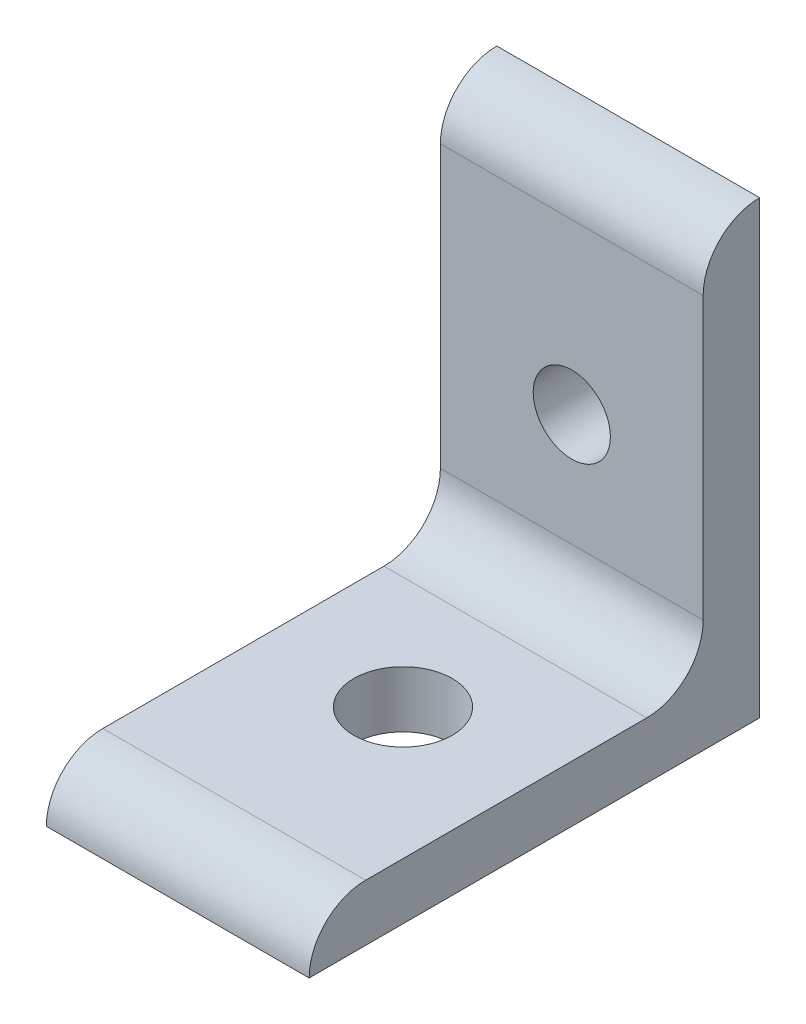
ISO-10303-21;
HEADER;
FILE_DESCRIPTION(('STEP AP214'),'2;1');
FILE_NAME('part.step','',(''),(''),'','','');
FILE_SCHEMA(('AUTOMOTIVE_DESIGN { 1 0 10303 214 1 1 1 1 }'));
ENDSEC;
DATA;
#1=APPLICATION_CONTEXT('core data for automotive mechanical design processes');
#2=APPLICATION_PROTOCOL_DEFINITION('international standard','automotive_design',2000,#1);
#3=PRODUCT_CONTEXT('',#1,'mechanical');
#4=PRODUCT('Part','Part','',(#3));
#5=PRODUCT_RELATED_PRODUCT_CATEGORY('part','',(#4));
#6=PRODUCT_DEFINITION_FORMATION('','',#4);
#7=PRODUCT_DEFINITION_CONTEXT('part definition',#1,'design');
#8=PRODUCT_DEFINITION('design','',#6,#7);
#9=PRODUCT_DEFINITION_SHAPE('','',#8);
#10=(LENGTH_UNIT() NAMED_UNIT(*) SI_UNIT(.MILLI.,.METRE.));
#11=(NAMED_UNIT(*) PLANE_ANGLE_UNIT() SI_UNIT($,.RADIAN.));
#12=(NAMED_UNIT(*) SI_UNIT($,.STERADIAN.) SOLID_ANGLE_UNIT());
#13=UNCERTAINTY_MEASURE_WITH_UNIT(LENGTH_MEASURE(1.E-05),#10,'distance_accuracy_value','');
#14=(GEOMETRIC_REPRESENTATION_CONTEXT(3) GLOBAL_UNCERTAINTY_ASSIGNED_CONTEXT((#13)) GLOBAL_UNIT_ASSIGNED_CONTEXT((#10,
#11,#12)) REPRESENTATION_CONTEXT('',''));
#15=CARTESIAN_POINT('',(0.,0.,0.));
#16=DIRECTION('',(0.,0.,1.));
#17=DIRECTION('',(1.,0.,0.));
#18=AXIS2_PLACEMENT_3D('',#15,#16,#17);
#19=CARTESIAN_POINT('',(-11.1125,9.5504,9.5504));
#20=DIRECTION('',(1.,0.,0.));
#21=DIRECTION('',(0.,0.,-1.));
#22=AXIS2_PLACEMENT_3D('',#19,#20,#21);
#23=CYLINDRICAL_SURFACE('',#22,4.7752);
#24=CARTESIAN_POINT('',(11.1125,9.5504,9.5504));
#25=DIRECTION('',(-1.,0.,0.));
#26=DIRECTION('',(0.,0.,-1.));
#27=AXIS2_PLACEMENT_3D('',#24,#25,#26);
#28=CIRCLE('',#27,4.7752);
#29=CARTESIAN_POINT('',(11.1125,9.5504,4.7752));
#30=VERTEX_POINT('',#29);
#31=CARTESIAN_POINT('',(11.1125,4.7752,9.5504));
#32=VERTEX_POINT('',#31);
#33=EDGE_CURVE('E125',#30,#32,#28,.T.);
#34=ORIENTED_EDGE('',*,*,#33,.F.);
#35=DIRECTION('',(1.,0.,0.));
#36=VECTOR('',#35,1.);
#37=CARTESIAN_POINT('',(-11.1125,9.5504,4.7752));
#38=LINE('',#37,#36);
#39=CARTESIAN_POINT('',(-11.1125,9.5504,4.7752));
#40=VERTEX_POINT('',#39);
#41=EDGE_CURVE('E11',#40,#30,#38,.T.);
#42=ORIENTED_EDGE('',*,*,#41,.F.);
#43=CARTESIAN_POINT('',(-11.1125,9.5504,9.5504));
#44=DIRECTION('',(-1.,0.,0.));
#45=DIRECTION('',(0.,0.,-1.));
#46=AXIS2_PLACEMENT_3D('',#43,#44,#45);
#47=CIRCLE('',#46,4.7752);
#48=CARTESIAN_POINT('',(-11.1125,4.7752,9.5504));
#49=VERTEX_POINT('',#48);
#50=EDGE_CURVE('E142',#40,#49,#47,.T.);
#51=ORIENTED_EDGE('',*,*,#50,.T.);
#52=DIRECTION('',(1.,0.,0.));
#53=VECTOR('',#52,1.);
#54=CARTESIAN_POINT('',(-11.1125,4.7752,9.5504));
#55=LINE('',#54,#53);
#56=EDGE_CURVE('E86',#49,#32,#55,.T.);
#57=ORIENTED_EDGE('',*,*,#56,.T.);
#58=EDGE_LOOP('',(#34,#42,#51,#57));
#59=FACE_BOUND('',#58,.T.);
#60=ADVANCED_FACE('F33',(#59),#23,.F.);
#61=CARTESIAN_POINT('',(-11.1125,9.5504,4.7752));
#62=DIRECTION('',(0.,0.,1.));
#63=DIRECTION('',(0.,-1.,0.));
#64=AXIS2_PLACEMENT_3D('',#61,#62,#63);
#65=PLANE('',#64);
#66=CARTESIAN_POINT('',(0.,19.05,4.77520000000001));
#67=DIRECTION('',(0.,0.,1.));
#68=DIRECTION('',(0.,-1.,0.));
#69=AXIS2_PLACEMENT_3D('',#66,#67,#68);
#70=CIRCLE('',#69,3.2639);
#71=CARTESIAN_POINT('',(0.,15.7861,4.77520000000001));
#72=VERTEX_POINT('',#71);
#73=EDGE_CURVE('E186',#72,#72,#70,.T.);
#74=ORIENTED_EDGE('',*,*,#73,.F.);
#75=EDGE_LOOP('',(#74));
#76=FACE_BOUND('',#75,.T.);
#77=DIRECTION('',(0.,-1.,0.));
#78=VECTOR('',#77,1.);
#79=CARTESIAN_POINT('',(11.1125,9.5504,4.7752));
#80=LINE('',#79,#78);
#81=CARTESIAN_POINT('',(11.1125,33.3248,4.77520000000001));
#82=VERTEX_POINT('',#81);
#83=EDGE_CURVE('E140',#82,#30,#80,.T.);
#84=ORIENTED_EDGE('',*,*,#83,.F.);
#85=DIRECTION('',(1.,0.,0.));
#86=VECTOR('',#85,1.);
#87=CARTESIAN_POINT('',(-11.1125,33.3248,4.77520000000001));
#88=LINE('',#87,#86);
#89=CARTESIAN_POINT('',(-11.1125,33.3248,4.77520000000001));
#90=VERTEX_POINT('',#89);
#91=EDGE_CURVE('E42',#90,#82,#88,.T.);
#92=ORIENTED_EDGE('',*,*,#91,.F.);
#93=DIRECTION('',(0.,-1.,0.));
#94=VECTOR('',#93,1.);
#95=CARTESIAN_POINT('',(-11.1125,9.5504,4.7752));
#96=LINE('',#95,#94);
#97=EDGE_CURVE('E115',#90,#40,#96,.T.);
#98=ORIENTED_EDGE('',*,*,#97,.T.);
#99=ORIENTED_EDGE('',*,*,#41,.T.);
#100=EDGE_LOOP('',(#84,#92,#98,#99));
#101=FACE_BOUND('',#100,.T.);
#102=ADVANCED_FACE('F153',(#76,#101),#65,.T.);
#103=CARTESIAN_POINT('',(-11.1125,33.3248,0.));
#104=DIRECTION('',(1.,0.,0.));
#105=DIRECTION('',(0.,0.,-1.));
#106=AXIS2_PLACEMENT_3D('',#103,#104,#105);
#107=CYLINDRICAL_SURFACE('',#106,4.7752);
#108=CARTESIAN_POINT('',(11.1125,33.3248,0.));
#109=DIRECTION('',(1.,0.,0.));
#110=DIRECTION('',(0.,0.,-1.));
#111=AXIS2_PLACEMENT_3D('',#108,#109,#110);
#112=CIRCLE('',#111,4.7752);
#113=CARTESIAN_POINT('',(11.1125,38.1,0.));
#114=VERTEX_POINT('',#113);
#115=EDGE_CURVE('E102',#114,#82,#112,.T.);
#116=ORIENTED_EDGE('',*,*,#115,.F.);
#117=DIRECTION('',(1.,0.,0.));
#118=VECTOR('',#117,1.);
#119=CARTESIAN_POINT('',(-11.1125,38.1,0.));
#120=LINE('',#119,#118);
#121=CARTESIAN_POINT('',(-11.1125,38.1,0.));
#122=VERTEX_POINT('',#121);
#123=EDGE_CURVE('E97',#122,#114,#120,.T.);
#124=ORIENTED_EDGE('',*,*,#123,.F.);
#125=CARTESIAN_POINT('',(-11.1125,33.3248,0.));
#126=DIRECTION('',(1.,0.,0.));
#127=DIRECTION('',(0.,0.,-1.));
#128=AXIS2_PLACEMENT_3D('',#125,#126,#127);
#129=CIRCLE('',#128,4.7752);
#130=EDGE_CURVE('E100',#122,#90,#129,.T.);
#131=ORIENTED_EDGE('',*,*,#130,.T.);
#132=ORIENTED_EDGE('',*,*,#91,.T.);
#133=EDGE_LOOP('',(#116,#124,#131,#132));
#134=FACE_BOUND('',#133,.T.);
#135=ADVANCED_FACE('F99',(#134),#107,.T.);
#136=CARTESIAN_POINT('',(-11.1125,0.,0.));
#137=DIRECTION('',(0.,0.,-1.));
#138=DIRECTION('',(0.,1.,0.));
#139=AXIS2_PLACEMENT_3D('',#136,#137,#138);
#140=PLANE('',#139);
#141=CARTESIAN_POINT('',(0.,19.05,0.));
#142=DIRECTION('',(0.,0.,-1.));
#143=DIRECTION('',(0.,1.,0.));
#144=AXIS2_PLACEMENT_3D('',#141,#142,#143);
#145=CIRCLE('',#144,3.2639);
#146=CARTESIAN_POINT('',(0.,22.3139,0.));
#147=VERTEX_POINT('',#146);
#148=EDGE_CURVE('E191',#147,#147,#145,.T.);
#149=ORIENTED_EDGE('',*,*,#148,.F.);
#150=EDGE_LOOP('',(#149));
#151=FACE_BOUND('',#150,.T.);
#152=DIRECTION('',(0.,1.,0.));
#153=VECTOR('',#152,1.);
#154=CARTESIAN_POINT('',(11.1125,0.,0.));
#155=LINE('',#154,#153);
#156=CARTESIAN_POINT('',(11.1125,0.,0.));
#157=VERTEX_POINT('',#156);
#158=EDGE_CURVE('E137',#157,#114,#155,.T.);
#159=ORIENTED_EDGE('',*,*,#158,.F.);
#160=DIRECTION('',(1.,0.,0.));
#161=VECTOR('',#160,1.);
#162=CARTESIAN_POINT('',(-11.1125,0.,0.));
#163=LINE('',#162,#161);
#164=CARTESIAN_POINT('',(-11.1125,0.,0.));
#165=VERTEX_POINT('',#164);
#166=EDGE_CURVE('E107',#165,#157,#163,.T.);
#167=ORIENTED_EDGE('',*,*,#166,.F.);
#168=DIRECTION('',(0.,1.,0.));
#169=VECTOR('',#168,1.);
#170=CARTESIAN_POINT('',(-11.1125,0.,0.));
#171=LINE('',#170,#169);
#172=EDGE_CURVE('E113',#165,#122,#171,.T.);
#173=ORIENTED_EDGE('',*,*,#172,.T.);
#174=ORIENTED_EDGE('',*,*,#123,.T.);
#175=EDGE_LOOP('',(#159,#167,#173,#174));
#176=FACE_BOUND('',#175,.T.);
#177=ADVANCED_FACE('F117',(#151,#176),#140,.T.);
#178=CARTESIAN_POINT('',(-11.1125,0.,38.1));
#179=DIRECTION('',(0.,-1.,0.));
#180=DIRECTION('',(0.,0.,-1.));
#181=AXIS2_PLACEMENT_3D('',#178,#179,#180);
#182=PLANE('',#181);
#183=CARTESIAN_POINT('',(0.,0.,19.05));
#184=DIRECTION('',(0.,-1.,0.));
#185=DIRECTION('',(0.,0.,-1.));
#186=AXIS2_PLACEMENT_3D('',#183,#184,#185);
#187=CIRCLE('',#186,4.1656);
#188=CARTESIAN_POINT('',(0.,0.,14.8844));
#189=VERTEX_POINT('',#188);
#190=EDGE_CURVE('E184',#189,#189,#187,.T.);
#191=ORIENTED_EDGE('',*,*,#190,.F.);
#192=EDGE_LOOP('',(#191));
#193=FACE_BOUND('',#192,.T.);
#194=DIRECTION('',(0.,0.,-1.));
#195=VECTOR('',#194,1.);
#196=CARTESIAN_POINT('',(11.1125,0.,38.1));
#197=LINE('',#196,#195);
#198=CARTESIAN_POINT('',(11.1125,0.,38.1));
#199=VERTEX_POINT('',#198);
#200=EDGE_CURVE('E134',#199,#157,#197,.T.);
#201=ORIENTED_EDGE('',*,*,#200,.F.);
#202=DIRECTION('',(1.,0.,0.));
#203=VECTOR('',#202,1.);
#204=CARTESIAN_POINT('',(-11.1125,0.,38.1));
#205=LINE('',#204,#203);
#206=CARTESIAN_POINT('',(-11.1125,0.,38.1));
#207=VERTEX_POINT('',#206);
#208=EDGE_CURVE('E146',#207,#199,#205,.T.);
#209=ORIENTED_EDGE('',*,*,#208,.F.);
#210=DIRECTION('',(0.,0.,-1.));
#211=VECTOR('',#210,1.);
#212=CARTESIAN_POINT('',(-11.1125,0.,38.1));
#213=LINE('',#212,#211);
#214=EDGE_CURVE('E118',#207,#165,#213,.T.);
#215=ORIENTED_EDGE('',*,*,#214,.T.);
#216=ORIENTED_EDGE('',*,*,#166,.T.);
#217=EDGE_LOOP('',(#201,#209,#215,#216));
#218=FACE_BOUND('',#217,.T.);
#219=ADVANCED_FACE('F168',(#193,#218),#182,.T.);
#220=CARTESIAN_POINT('',(-11.1125,0.,33.3248));
#221=DIRECTION('',(1.,0.,0.));
#222=DIRECTION('',(0.,0.,-1.));
#223=AXIS2_PLACEMENT_3D('',#220,#221,#222);
#224=CYLINDRICAL_SURFACE('',#223,4.7752);
#225=CARTESIAN_POINT('',(11.1125,0.,33.3248));
#226=DIRECTION('',(1.,0.,0.));
#227=DIRECTION('',(0.,0.,-1.));
#228=AXIS2_PLACEMENT_3D('',#225,#226,#227);
#229=CIRCLE('',#228,4.7752);
#230=CARTESIAN_POINT('',(11.1125,4.7752,33.3248));
#231=VERTEX_POINT('',#230);
#232=EDGE_CURVE('E131',#231,#199,#229,.T.);
#233=ORIENTED_EDGE('',*,*,#232,.F.);
#234=DIRECTION('',(1.,0.,0.));
#235=VECTOR('',#234,1.);
#236=CARTESIAN_POINT('',(-11.1125,4.7752,33.3248));
#237=LINE('',#236,#235);
#238=CARTESIAN_POINT('',(-11.1125,4.7752,33.3248));
#239=VERTEX_POINT('',#238);
#240=EDGE_CURVE('E148',#239,#231,#237,.T.);
#241=ORIENTED_EDGE('',*,*,#240,.F.);
#242=CARTESIAN_POINT('',(-11.1125,0.,33.3248));
#243=DIRECTION('',(1.,0.,0.));
#244=DIRECTION('',(0.,0.,-1.));
#245=AXIS2_PLACEMENT_3D('',#242,#243,#244);
#246=CIRCLE('',#245,4.7752);
#247=EDGE_CURVE('E120',#239,#207,#246,.T.);
#248=ORIENTED_EDGE('',*,*,#247,.T.);
#249=ORIENTED_EDGE('',*,*,#208,.T.);
#250=EDGE_LOOP('',(#233,#241,#248,#249));
#251=FACE_BOUND('',#250,.T.);
#252=ADVANCED_FACE('F172',(#251),#224,.T.);
#253=CARTESIAN_POINT('',(-11.1125,4.7752,33.3248));
#254=DIRECTION('',(0.,1.,0.));
#255=DIRECTION('',(0.,0.,1.));
#256=AXIS2_PLACEMENT_3D('',#253,#254,#255);
#257=PLANE('',#256);
#258=CARTESIAN_POINT('',(0.,4.7752,19.05));
#259=DIRECTION('',(0.,1.,0.));
#260=DIRECTION('',(0.,0.,1.));
#261=AXIS2_PLACEMENT_3D('',#258,#259,#260);
#262=CIRCLE('',#261,4.1656);
#263=CARTESIAN_POINT('',(0.,4.7752,23.2156));
#264=VERTEX_POINT('',#263);
#265=EDGE_CURVE('E36',#264,#264,#262,.T.);
#266=ORIENTED_EDGE('',*,*,#265,.F.);
#267=EDGE_LOOP('',(#266));
#268=FACE_BOUND('',#267,.T.);
#269=DIRECTION('',(0.,0.,1.));
#270=VECTOR('',#269,1.);
#271=CARTESIAN_POINT('',(11.1125,4.7752,33.3248));
#272=LINE('',#271,#270);
#273=EDGE_CURVE('E128',#32,#231,#272,.T.);
#274=ORIENTED_EDGE('',*,*,#273,.F.);
#275=ORIENTED_EDGE('',*,*,#56,.F.);
#276=DIRECTION('',(0.,0.,1.));
#277=VECTOR('',#276,1.);
#278=CARTESIAN_POINT('',(-11.1125,4.7752,33.3248));
#279=LINE('',#278,#277);
#280=EDGE_CURVE('E196',#49,#239,#279,.T.);
#281=ORIENTED_EDGE('',*,*,#280,.T.);
#282=ORIENTED_EDGE('',*,*,#240,.T.);
#283=EDGE_LOOP('',(#274,#275,#281,#282));
#284=FACE_BOUND('',#283,.T.);
#285=ADVANCED_FACE('F149',(#268,#284),#257,.T.);
#286=CARTESIAN_POINT('',(-11.1125,9.5504,9.5504));
#287=DIRECTION('',(1.,0.,0.));
#288=DIRECTION('',(0.,0.,-1.));
#289=AXIS2_PLACEMENT_3D('',#286,#287,#288);
#290=PLANE('',#289);
#291=ORIENTED_EDGE('',*,*,#50,.F.);
#292=ORIENTED_EDGE('',*,*,#97,.F.);
#293=ORIENTED_EDGE('',*,*,#130,.F.);
#294=ORIENTED_EDGE('',*,*,#172,.F.);
#295=ORIENTED_EDGE('',*,*,#214,.F.);
#296=ORIENTED_EDGE('',*,*,#247,.F.);
#297=ORIENTED_EDGE('',*,*,#280,.F.);
#298=EDGE_LOOP('',(#291,#292,#293,#294,#295,#296,#297));
#299=FACE_BOUND('',#298,.T.);
#300=ADVANCED_FACE('F111',(#299),#290,.F.);
#301=CARTESIAN_POINT('',(11.1125,9.5504,9.5504));
#302=DIRECTION('',(1.,0.,0.));
#303=DIRECTION('',(0.,0.,-1.));
#304=AXIS2_PLACEMENT_3D('',#301,#302,#303);
#305=PLANE('',#304);
#306=ORIENTED_EDGE('',*,*,#33,.T.);
#307=ORIENTED_EDGE('',*,*,#273,.T.);
#308=ORIENTED_EDGE('',*,*,#232,.T.);
#309=ORIENTED_EDGE('',*,*,#200,.T.);
#310=ORIENTED_EDGE('',*,*,#158,.T.);
#311=ORIENTED_EDGE('',*,*,#115,.T.);
#312=ORIENTED_EDGE('',*,*,#83,.T.);
#313=EDGE_LOOP('',(#306,#307,#308,#309,#310,#311,#312));
#314=FACE_BOUND('',#313,.T.);
#315=ADVANCED_FACE('F152',(#314),#305,.T.);
#316=CARTESIAN_POINT('',(0.,38.1,19.05));
#317=DIRECTION('',(0.,-1.,0.));
#318=DIRECTION('',(0.,0.,-1.));
#319=AXIS2_PLACEMENT_3D('',#316,#317,#318);
#320=CYLINDRICAL_SURFACE('',#319,4.1656);
#321=ORIENTED_EDGE('',*,*,#265,.T.);
#322=EDGE_LOOP('',(#321));
#323=FACE_BOUND('',#322,.T.);
#324=ORIENTED_EDGE('',*,*,#190,.T.);
#325=EDGE_LOOP('',(#324));
#326=FACE_BOUND('',#325,.T.);
#327=ADVANCED_FACE('F206',(#323,#326),#320,.F.);
#328=CARTESIAN_POINT('',(0.,19.05,38.1));
#329=DIRECTION('',(0.,0.,-1.));
#330=DIRECTION('',(0.,1.,0.));
#331=AXIS2_PLACEMENT_3D('',#328,#329,#330);
#332=CYLINDRICAL_SURFACE('',#331,3.2639);
#333=ORIENTED_EDGE('',*,*,#73,.T.);
#334=EDGE_LOOP('',(#333));
#335=FACE_BOUND('',#334,.T.);
#336=ORIENTED_EDGE('',*,*,#148,.T.);
#337=EDGE_LOOP('',(#336));
#338=FACE_BOUND('',#337,.T.);
#339=ADVANCED_FACE('F204',(#335,#338),#332,.F.);
#340=CLOSED_SHELL('',(#60,#102,#135,#177,#219,#252,#285,#300,#315,#327,#339));
#341=MANIFOLD_SOLID_BREP('B2',#340);
#342=ADVANCED_BREP_SHAPE_REPRESENTATION('',(#18,#341),#14);
#343=SHAPE_DEFINITION_REPRESENTATION(#9,#342);
ENDSEC;
END-ISO-10303-21;
